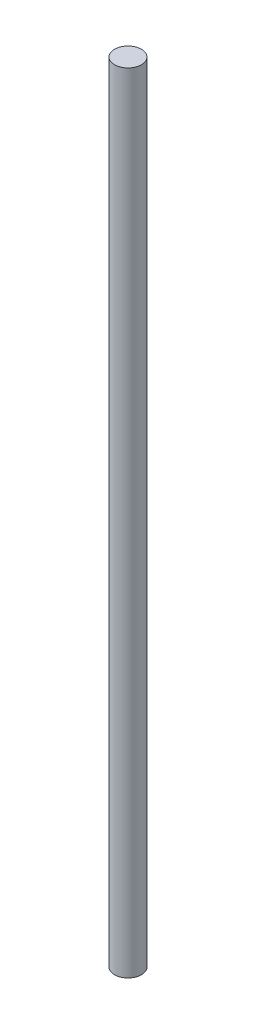
ISO-10303-21;
HEADER;
FILE_DESCRIPTION(('STEP AP214'),'2;1');
FILE_NAME('part.step','',(''),(''),'','','');
FILE_SCHEMA(('AUTOMOTIVE_DESIGN { 1 0 10303 214 1 1 1 1 }'));
ENDSEC;
DATA;
#1=APPLICATION_CONTEXT('core data for automotive mechanical design processes');
#2=APPLICATION_PROTOCOL_DEFINITION('international standard','automotive_design',2000,#1);
#3=PRODUCT_CONTEXT('',#1,'mechanical');
#4=PRODUCT('Part','Part','',(#3));
#5=PRODUCT_RELATED_PRODUCT_CATEGORY('part','',(#4));
#6=PRODUCT_DEFINITION_FORMATION('','',#4);
#7=PRODUCT_DEFINITION_CONTEXT('part definition',#1,'design');
#8=PRODUCT_DEFINITION('design','',#6,#7);
#9=PRODUCT_DEFINITION_SHAPE('','',#8);
#10=(LENGTH_UNIT() NAMED_UNIT(*) SI_UNIT(.MILLI.,.METRE.));
#11=(NAMED_UNIT(*) PLANE_ANGLE_UNIT() SI_UNIT($,.RADIAN.));
#12=(NAMED_UNIT(*) SI_UNIT($,.STERADIAN.) SOLID_ANGLE_UNIT());
#13=UNCERTAINTY_MEASURE_WITH_UNIT(LENGTH_MEASURE(1.E-05),#10,'distance_accuracy_value','');
#14=(GEOMETRIC_REPRESENTATION_CONTEXT(3) GLOBAL_UNCERTAINTY_ASSIGNED_CONTEXT((#13)) GLOBAL_UNIT_ASSIGNED_CONTEXT((#10,
#11,#12)) REPRESENTATION_CONTEXT('',''));
#15=CARTESIAN_POINT('',(0.,0.,0.));
#16=DIRECTION('',(0.,0.,1.));
#17=DIRECTION('',(1.,0.,0.));
#18=AXIS2_PLACEMENT_3D('',#15,#16,#17);
#19=CARTESIAN_POINT('',(0.,732.5,0.));
#20=DIRECTION('',(0.,-1.,0.));
#21=DIRECTION('',(0.,0.,-1.));
#22=AXIS2_PLACEMENT_3D('',#19,#20,#21);
#23=CYLINDRICAL_SURFACE('',#22,12.5);
#24=CARTESIAN_POINT('',(0.,732.5,0.));
#25=DIRECTION('',(0.,1.,0.));
#26=DIRECTION('',(0.,0.,1.));
#27=AXIS2_PLACEMENT_3D('',#24,#25,#26);
#28=CIRCLE('',#27,12.5);
#29=CARTESIAN_POINT('',(0.,732.5,12.5));
#30=VERTEX_POINT('',#29);
#31=EDGE_CURVE('E10',#30,#30,#28,.T.);
#32=ORIENTED_EDGE('',*,*,#31,.F.);
#33=EDGE_LOOP('',(#32));
#34=FACE_BOUND('',#33,.T.);
#35=CARTESIAN_POINT('',(0.,0.,0.));
#36=DIRECTION('',(0.,1.,0.));
#37=DIRECTION('',(0.,0.,1.));
#38=AXIS2_PLACEMENT_3D('',#35,#36,#37);
#39=CIRCLE('',#38,12.5);
#40=CARTESIAN_POINT('',(0.,0.,12.5));
#41=VERTEX_POINT('',#40);
#42=EDGE_CURVE('E34',#41,#41,#39,.T.);
#43=ORIENTED_EDGE('',*,*,#42,.T.);
#44=EDGE_LOOP('',(#43));
#45=FACE_BOUND('',#44,.T.);
#46=ADVANCED_FACE('F31',(#34,#45),#23,.T.);
#47=CARTESIAN_POINT('',(0.,732.5,0.));
#48=DIRECTION('',(0.,1.,0.));
#49=DIRECTION('',(0.,0.,1.));
#50=AXIS2_PLACEMENT_3D('',#47,#48,#49);
#51=PLANE('',#50);
#52=ORIENTED_EDGE('',*,*,#31,.T.);
#53=EDGE_LOOP('',(#52));
#54=FACE_BOUND('',#53,.T.);
#55=ADVANCED_FACE('F46',(#54),#51,.T.);
#56=CARTESIAN_POINT('',(0.,0.,0.));
#57=DIRECTION('',(0.,1.,0.));
#58=DIRECTION('',(0.,0.,1.));
#59=AXIS2_PLACEMENT_3D('',#56,#57,#58);
#60=PLANE('',#59);
#61=ORIENTED_EDGE('',*,*,#42,.F.);
#62=EDGE_LOOP('',(#61));
#63=FACE_BOUND('',#62,.T.);
#64=ADVANCED_FACE('F44',(#63),#60,.F.);
#65=CLOSED_SHELL('',(#46,#55,#64));
#66=MANIFOLD_SOLID_BREP('B2',#65);
#67=ADVANCED_BREP_SHAPE_REPRESENTATION('',(#18,#66),#14);
#68=SHAPE_DEFINITION_REPRESENTATION(#9,#67);
ENDSEC;
END-ISO-10303-21;
